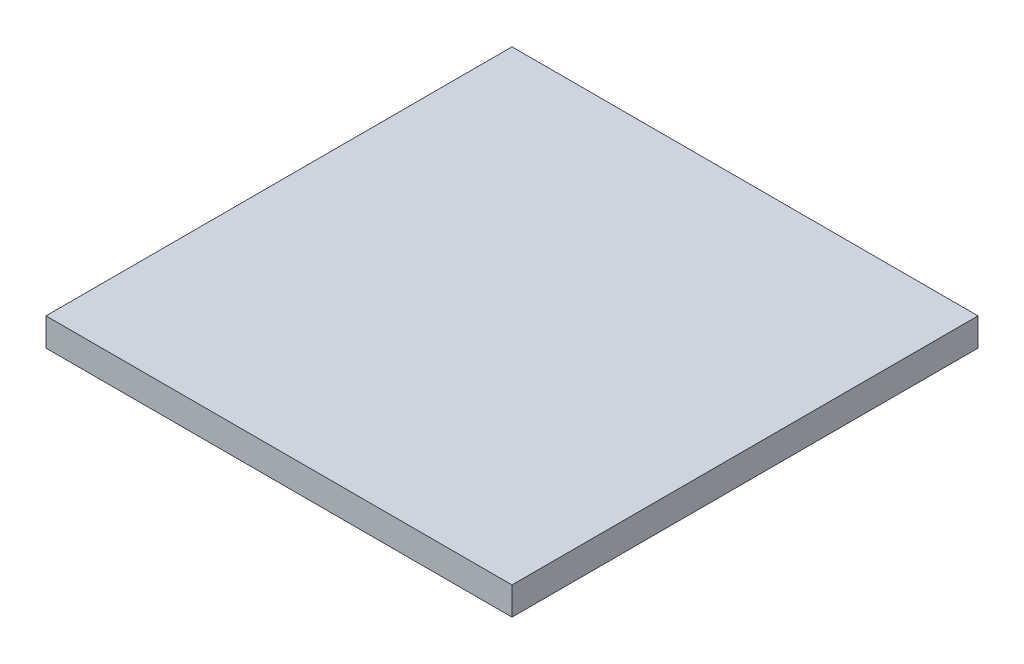
ISO-10303-21;
HEADER;
FILE_DESCRIPTION(('STEP AP214'),'2;1');
FILE_NAME('part.step','',(''),(''),'','','');
FILE_SCHEMA(('AUTOMOTIVE_DESIGN { 1 0 10303 214 1 1 1 1 }'));
ENDSEC;
DATA;
#1=APPLICATION_CONTEXT('core data for automotive mechanical design processes');
#2=APPLICATION_PROTOCOL_DEFINITION('international standard','automotive_design',2000,#1);
#3=PRODUCT_CONTEXT('',#1,'mechanical');
#4=PRODUCT('Part','Part','',(#3));
#5=PRODUCT_RELATED_PRODUCT_CATEGORY('part','',(#4));
#6=PRODUCT_DEFINITION_FORMATION('','',#4);
#7=PRODUCT_DEFINITION_CONTEXT('part definition',#1,'design');
#8=PRODUCT_DEFINITION('design','',#6,#7);
#9=PRODUCT_DEFINITION_SHAPE('','',#8);
#10=(LENGTH_UNIT() NAMED_UNIT(*) SI_UNIT(.MILLI.,.METRE.));
#11=(NAMED_UNIT(*) PLANE_ANGLE_UNIT() SI_UNIT($,.RADIAN.));
#12=(NAMED_UNIT(*) SI_UNIT($,.STERADIAN.) SOLID_ANGLE_UNIT());
#13=UNCERTAINTY_MEASURE_WITH_UNIT(LENGTH_MEASURE(1.E-05),#10,'distance_accuracy_value','');
#14=(GEOMETRIC_REPRESENTATION_CONTEXT(3) GLOBAL_UNCERTAINTY_ASSIGNED_CONTEXT((#13)) GLOBAL_UNIT_ASSIGNED_CONTEXT((#10,
#11,#12)) REPRESENTATION_CONTEXT('',''));
#15=CARTESIAN_POINT('',(0.,0.,0.));
#16=DIRECTION('',(0.,0.,1.));
#17=DIRECTION('',(1.,0.,0.));
#18=AXIS2_PLACEMENT_3D('',#15,#16,#17);
#19=CARTESIAN_POINT('',(25.,3.,-25.));
#20=DIRECTION('',(-1.,0.,0.));
#21=DIRECTION('',(0.,0.,1.));
#22=AXIS2_PLACEMENT_3D('',#19,#20,#21);
#23=PLANE('',#22);
#24=DIRECTION('',(0.,0.,-1.));
#25=VECTOR('',#24,1.);
#26=CARTESIAN_POINT('',(25.,0.,-25.));
#27=LINE('',#26,#25);
#28=CARTESIAN_POINT('',(25.,0.,25.));
#29=VERTEX_POINT('',#28);
#30=CARTESIAN_POINT('',(25.,0.,-25.));
#31=VERTEX_POINT('',#30);
#32=EDGE_CURVE('E100',#29,#31,#27,.T.);
#33=ORIENTED_EDGE('',*,*,#32,.T.);
#34=DIRECTION('',(0.,-1.,0.));
#35=VECTOR('',#34,1.);
#36=CARTESIAN_POINT('',(25.,3.,-25.));
#37=LINE('',#36,#35);
#38=CARTESIAN_POINT('',(25.,3.,-25.));
#39=VERTEX_POINT('',#38);
#40=EDGE_CURVE('E11',#39,#31,#37,.T.);
#41=ORIENTED_EDGE('',*,*,#40,.F.);
#42=DIRECTION('',(0.,0.,-1.));
#43=VECTOR('',#42,1.);
#44=CARTESIAN_POINT('',(25.,3.,-25.));
#45=LINE('',#44,#43);
#46=CARTESIAN_POINT('',(25.,3.,25.));
#47=VERTEX_POINT('',#46);
#48=EDGE_CURVE('E88',#47,#39,#45,.T.);
#49=ORIENTED_EDGE('',*,*,#48,.F.);
#50=DIRECTION('',(0.,-1.,0.));
#51=VECTOR('',#50,1.);
#52=CARTESIAN_POINT('',(25.,3.,25.));
#53=LINE('',#52,#51);
#54=EDGE_CURVE('E96',#47,#29,#53,.T.);
#55=ORIENTED_EDGE('',*,*,#54,.T.);
#56=EDGE_LOOP('',(#33,#41,#49,#55));
#57=FACE_BOUND('',#56,.T.);
#58=ADVANCED_FACE('F37',(#57),#23,.F.);
#59=CARTESIAN_POINT('',(-25.,3.,-25.));
#60=DIRECTION('',(0.,0.,1.));
#61=DIRECTION('',(1.,0.,0.));
#62=AXIS2_PLACEMENT_3D('',#59,#60,#61);
#63=PLANE('',#62);
#64=DIRECTION('',(-1.,0.,0.));
#65=VECTOR('',#64,1.);
#66=CARTESIAN_POINT('',(-25.,0.,-25.));
#67=LINE('',#66,#65);
#68=CARTESIAN_POINT('',(-25.,0.,-25.));
#69=VERTEX_POINT('',#68);
#70=EDGE_CURVE('E92',#31,#69,#67,.T.);
#71=ORIENTED_EDGE('',*,*,#70,.T.);
#72=DIRECTION('',(0.,-1.,0.));
#73=VECTOR('',#72,1.);
#74=CARTESIAN_POINT('',(-25.,3.,-25.));
#75=LINE('',#74,#73);
#76=CARTESIAN_POINT('',(-25.,3.,-25.));
#77=VERTEX_POINT('',#76);
#78=EDGE_CURVE('E45',#77,#69,#75,.T.);
#79=ORIENTED_EDGE('',*,*,#78,.F.);
#80=DIRECTION('',(-1.,0.,0.));
#81=VECTOR('',#80,1.);
#82=CARTESIAN_POINT('',(-25.,3.,-25.));
#83=LINE('',#82,#81);
#84=EDGE_CURVE('E83',#39,#77,#83,.T.);
#85=ORIENTED_EDGE('',*,*,#84,.F.);
#86=ORIENTED_EDGE('',*,*,#40,.T.);
#87=EDGE_LOOP('',(#71,#79,#85,#86));
#88=FACE_BOUND('',#87,.T.);
#89=ADVANCED_FACE('F91',(#88),#63,.F.);
#90=CARTESIAN_POINT('',(-25.,3.,-25.));
#91=DIRECTION('',(1.,0.,0.));
#92=DIRECTION('',(0.,0.,-1.));
#93=AXIS2_PLACEMENT_3D('',#90,#91,#92);
#94=PLANE('',#93);
#95=DIRECTION('',(0.,0.,1.));
#96=VECTOR('',#95,1.);
#97=CARTESIAN_POINT('',(-25.,0.,-25.));
#98=LINE('',#97,#96);
#99=CARTESIAN_POINT('',(-25.,0.,25.));
#100=VERTEX_POINT('',#99);
#101=EDGE_CURVE('E70',#69,#100,#98,.T.);
#102=ORIENTED_EDGE('',*,*,#101,.T.);
#103=DIRECTION('',(0.,-1.,0.));
#104=VECTOR('',#103,1.);
#105=CARTESIAN_POINT('',(-25.,3.,25.));
#106=LINE('',#105,#104);
#107=CARTESIAN_POINT('',(-25.,3.,25.));
#108=VERTEX_POINT('',#107);
#109=EDGE_CURVE('E93',#108,#100,#106,.T.);
#110=ORIENTED_EDGE('',*,*,#109,.F.);
#111=DIRECTION('',(0.,0.,1.));
#112=VECTOR('',#111,1.);
#113=CARTESIAN_POINT('',(-25.,3.,-25.));
#114=LINE('',#113,#112);
#115=EDGE_CURVE('E86',#77,#108,#114,.T.);
#116=ORIENTED_EDGE('',*,*,#115,.F.);
#117=ORIENTED_EDGE('',*,*,#78,.T.);
#118=EDGE_LOOP('',(#102,#110,#116,#117));
#119=FACE_BOUND('',#118,.T.);
#120=ADVANCED_FACE('F94',(#119),#94,.F.);
#121=CARTESIAN_POINT('',(-25.,3.,25.));
#122=DIRECTION('',(0.,0.,-1.));
#123=DIRECTION('',(-1.,0.,0.));
#124=AXIS2_PLACEMENT_3D('',#121,#122,#123);
#125=PLANE('',#124);
#126=DIRECTION('',(1.,0.,0.));
#127=VECTOR('',#126,1.);
#128=CARTESIAN_POINT('',(-25.,0.,25.));
#129=LINE('',#128,#127);
#130=EDGE_CURVE('E76',#100,#29,#129,.T.);
#131=ORIENTED_EDGE('',*,*,#130,.T.);
#132=ORIENTED_EDGE('',*,*,#54,.F.);
#133=DIRECTION('',(1.,0.,0.));
#134=VECTOR('',#133,1.);
#135=CARTESIAN_POINT('',(-25.,3.,25.));
#136=LINE('',#135,#134);
#137=EDGE_CURVE('E53',#108,#47,#136,.T.);
#138=ORIENTED_EDGE('',*,*,#137,.F.);
#139=ORIENTED_EDGE('',*,*,#109,.T.);
#140=EDGE_LOOP('',(#131,#132,#138,#139));
#141=FACE_BOUND('',#140,.T.);
#142=ADVANCED_FACE('F107',(#141),#125,.F.);
#143=CARTESIAN_POINT('',(0.,3.,0.));
#144=DIRECTION('',(0.,1.,0.));
#145=DIRECTION('',(0.,0.,1.));
#146=AXIS2_PLACEMENT_3D('',#143,#144,#145);
#147=PLANE('',#146);
#148=ORIENTED_EDGE('',*,*,#48,.T.);
#149=ORIENTED_EDGE('',*,*,#84,.T.);
#150=ORIENTED_EDGE('',*,*,#115,.T.);
#151=ORIENTED_EDGE('',*,*,#137,.T.);
#152=EDGE_LOOP('',(#148,#149,#150,#151));
#153=FACE_BOUND('',#152,.T.);
#154=ADVANCED_FACE('F84',(#153),#147,.T.);
#155=CARTESIAN_POINT('',(0.,0.,0.));
#156=DIRECTION('',(0.,1.,0.));
#157=DIRECTION('',(0.,0.,1.));
#158=AXIS2_PLACEMENT_3D('',#155,#156,#157);
#159=PLANE('',#158);
#160=ORIENTED_EDGE('',*,*,#32,.F.);
#161=ORIENTED_EDGE('',*,*,#130,.F.);
#162=ORIENTED_EDGE('',*,*,#101,.F.);
#163=ORIENTED_EDGE('',*,*,#70,.F.);
#164=EDGE_LOOP('',(#160,#161,#162,#163));
#165=FACE_BOUND('',#164,.T.);
#166=ADVANCED_FACE('F110',(#165),#159,.F.);
#167=CLOSED_SHELL('',(#58,#89,#120,#142,#154,#166));
#168=MANIFOLD_SOLID_BREP('B2',#167);
#169=ADVANCED_BREP_SHAPE_REPRESENTATION('',(#18,#168),#14);
#170=SHAPE_DEFINITION_REPRESENTATION(#9,#169);
ENDSEC;
END-ISO-10303-21;
